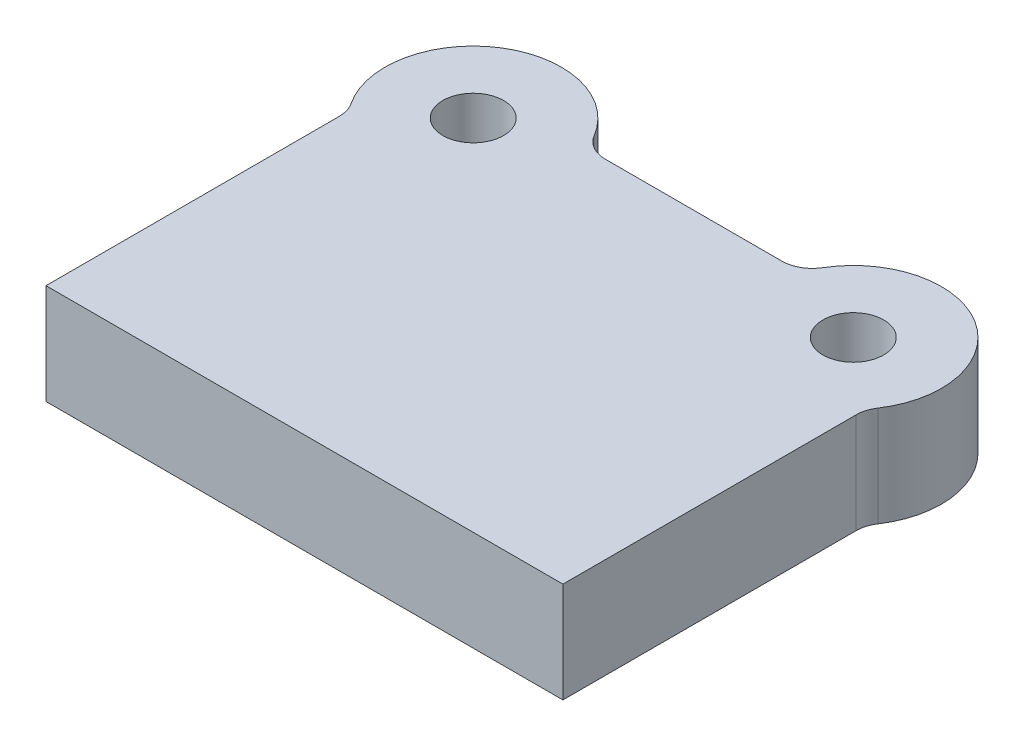
ISO-10303-21;
HEADER;
FILE_DESCRIPTION(('STEP AP214'),'2;1');
FILE_NAME('part.step','',(''),(''),'','','');
FILE_SCHEMA(('AUTOMOTIVE_DESIGN { 1 0 10303 214 1 1 1 1 }'));
ENDSEC;
DATA;
#1=APPLICATION_CONTEXT('core data for automotive mechanical design processes');
#2=APPLICATION_PROTOCOL_DEFINITION('international standard','automotive_design',2000,#1);
#3=PRODUCT_CONTEXT('',#1,'mechanical');
#4=PRODUCT('Part','Part','',(#3));
#5=PRODUCT_RELATED_PRODUCT_CATEGORY('part','',(#4));
#6=PRODUCT_DEFINITION_FORMATION('','',#4);
#7=PRODUCT_DEFINITION_CONTEXT('part definition',#1,'design');
#8=PRODUCT_DEFINITION('design','',#6,#7);
#9=PRODUCT_DEFINITION_SHAPE('','',#8);
#10=(LENGTH_UNIT() NAMED_UNIT(*) SI_UNIT(.MILLI.,.METRE.));
#11=(NAMED_UNIT(*) PLANE_ANGLE_UNIT() SI_UNIT($,.RADIAN.));
#12=(NAMED_UNIT(*) SI_UNIT($,.STERADIAN.) SOLID_ANGLE_UNIT());
#13=UNCERTAINTY_MEASURE_WITH_UNIT(LENGTH_MEASURE(1.E-05),#10,'distance_accuracy_value','');
#14=(GEOMETRIC_REPRESENTATION_CONTEXT(3) GLOBAL_UNCERTAINTY_ASSIGNED_CONTEXT((#13)) GLOBAL_UNIT_ASSIGNED_CONTEXT((#10,
#11,#12)) REPRESENTATION_CONTEXT('',''));
#15=CARTESIAN_POINT('',(0.,0.,0.));
#16=DIRECTION('',(0.,0.,1.));
#17=DIRECTION('',(1.,0.,0.));
#18=AXIS2_PLACEMENT_3D('',#15,#16,#17);
#19=CARTESIAN_POINT('',(-62.5,33.,-118.));
#20=DIRECTION('',(0.,1.,0.));
#21=DIRECTION('',(0.,0.,1.));
#22=AXIS2_PLACEMENT_3D('',#19,#20,#21);
#23=PLANE('',#22);
#24=CARTESIAN_POINT('',(-62.5,33.,-118.));
#25=DIRECTION('',(0.,1.,0.));
#26=DIRECTION('',(0.,0.,1.));
#27=AXIS2_PLACEMENT_3D('',#24,#25,#26);
#28=CIRCLE('',#27,10.);
#29=CARTESIAN_POINT('',(-62.5,33.,-108.));
#30=VERTEX_POINT('',#29);
#31=EDGE_CURVE('E209',#30,#30,#28,.T.);
#32=ORIENTED_EDGE('',*,*,#31,.F.);
#33=EDGE_LOOP('',(#32));
#34=FACE_BOUND('',#33,.T.);
#35=CARTESIAN_POINT('',(-62.5,33.,-118.));
#36=DIRECTION('',(0.,1.,0.));
#37=DIRECTION('',(0.,0.,1.));
#38=AXIS2_PLACEMENT_3D('',#35,#36,#37);
#39=CIRCLE('',#38,29.);
#40=CARTESIAN_POINT('',(-37.6036203979122,33.,-132.871794871795));
#41=VERTEX_POINT('',#40);
#42=CARTESIAN_POINT('',(-86.6666666666667,33.,-101.969646846616));
#43=VERTEX_POINT('',#42);
#44=EDGE_CURVE('E139',#41,#43,#39,.T.);
#45=ORIENTED_EDGE('',*,*,#44,.T.);
#46=CARTESIAN_POINT('',(-95.,33.,-96.4419388626899));
#47=DIRECTION('',(0.,1.,0.));
#48=DIRECTION('',(0.,0.,1.));
#49=AXIS2_PLACEMENT_3D('',#46,#47,#48);
#50=CIRCLE('',#49,10.);
#51=CARTESIAN_POINT('',(-85.,33.,-96.4419388626899));
#52=VERTEX_POINT('',#51);
#53=EDGE_CURVE('E116',#43,#52,#50,.F.);
#54=ORIENTED_EDGE('',*,*,#53,.T.);
#55=DIRECTION('',(0.,0.,1.));
#56=VECTOR('',#55,1.);
#57=CARTESIAN_POINT('',(-85.,33.,0.));
#58=LINE('',#57,#56);
#59=CARTESIAN_POINT('',(-85.,33.,0.));
#60=VERTEX_POINT('',#59);
#61=EDGE_CURVE('E109',#52,#60,#58,.T.);
#62=ORIENTED_EDGE('',*,*,#61,.T.);
#63=DIRECTION('',(1.,0.,0.));
#64=VECTOR('',#63,1.);
#65=CARTESIAN_POINT('',(85.,33.,0.));
#66=LINE('',#65,#64);
#67=CARTESIAN_POINT('',(85.,33.,0.));
#68=VERTEX_POINT('',#67);
#69=EDGE_CURVE('E113',#60,#68,#66,.T.);
#70=ORIENTED_EDGE('',*,*,#69,.T.);
#71=DIRECTION('',(0.,0.,-1.));
#72=VECTOR('',#71,1.);
#73=CARTESIAN_POINT('',(85.,33.,0.));
#74=LINE('',#73,#72);
#75=CARTESIAN_POINT('',(85.,33.,-96.4419388626899));
#76=VERTEX_POINT('',#75);
#77=EDGE_CURVE('E129',#68,#76,#74,.T.);
#78=ORIENTED_EDGE('',*,*,#77,.T.);
#79=CARTESIAN_POINT('',(95.,33.,-96.4419388626899));
#80=DIRECTION('',(0.,1.,0.));
#81=DIRECTION('',(0.,0.,1.));
#82=AXIS2_PLACEMENT_3D('',#79,#80,#81);
#83=CIRCLE('',#82,10.);
#84=CARTESIAN_POINT('',(86.6666666666667,33.,-101.969646846616));
#85=VERTEX_POINT('',#84);
#86=EDGE_CURVE('E11',#76,#85,#83,.F.);
#87=ORIENTED_EDGE('',*,*,#86,.T.);
#88=CARTESIAN_POINT('',(62.5,33.,-118.));
#89=DIRECTION('',(0.,1.,0.));
#90=DIRECTION('',(0.,0.,-1.));
#91=AXIS2_PLACEMENT_3D('',#88,#89,#90);
#92=CIRCLE('',#91,29.);
#93=CARTESIAN_POINT('',(37.6036203979122,33.,-132.871794871795));
#94=VERTEX_POINT('',#93);
#95=EDGE_CURVE('E175',#85,#94,#92,.T.);
#96=ORIENTED_EDGE('',*,*,#95,.T.);
#97=CARTESIAN_POINT('',(29.0186619144336,33.,-138.));
#98=DIRECTION('',(0.,1.,0.));
#99=DIRECTION('',(0.,0.,1.));
#100=AXIS2_PLACEMENT_3D('',#97,#98,#99);
#101=CIRCLE('',#100,10.);
#102=CARTESIAN_POINT('',(29.0186619144336,33.,-128.));
#103=VERTEX_POINT('',#102);
#104=EDGE_CURVE('E167',#94,#103,#101,.F.);
#105=ORIENTED_EDGE('',*,*,#104,.T.);
#106=DIRECTION('',(-1.,0.,0.));
#107=VECTOR('',#106,1.);
#108=CARTESIAN_POINT('',(35.2786848223676,33.,-128.));
#109=LINE('',#108,#107);
#110=CARTESIAN_POINT('',(-29.0186619144336,33.,-128.));
#111=VERTEX_POINT('',#110);
#112=EDGE_CURVE('E172',#103,#111,#109,.T.);
#113=ORIENTED_EDGE('',*,*,#112,.T.);
#114=CARTESIAN_POINT('',(-29.0186619144336,33.,-138.));
#115=DIRECTION('',(0.,1.,0.));
#116=DIRECTION('',(0.,0.,1.));
#117=AXIS2_PLACEMENT_3D('',#114,#115,#116);
#118=CIRCLE('',#117,10.);
#119=EDGE_CURVE('E163',#111,#41,#118,.F.);
#120=ORIENTED_EDGE('',*,*,#119,.T.);
#121=EDGE_LOOP('',(#45,#54,#62,#70,#78,#87,#96,#105,#113,#120));
#122=FACE_BOUND('',#121,.T.);
#123=CARTESIAN_POINT('',(62.5,33.,-118.));
#124=DIRECTION('',(0.,1.,0.));
#125=DIRECTION('',(0.,0.,-1.));
#126=AXIS2_PLACEMENT_3D('',#123,#124,#125);
#127=CIRCLE('',#126,9.99999999999999);
#128=CARTESIAN_POINT('',(62.5,33.,-128.));
#129=VERTEX_POINT('',#128);
#130=EDGE_CURVE('E219',#129,#129,#127,.T.);
#131=ORIENTED_EDGE('',*,*,#130,.F.);
#132=EDGE_LOOP('',(#131));
#133=FACE_BOUND('',#132,.T.);
#134=ADVANCED_FACE('F33',(#34,#122,#133),#23,.T.);
#135=CARTESIAN_POINT('',(-62.5,0.,-118.));
#136=DIRECTION('',(0.,1.,0.));
#137=DIRECTION('',(0.,0.,1.));
#138=AXIS2_PLACEMENT_3D('',#135,#136,#137);
#139=PLANE('',#138);
#140=DIRECTION('',(0.,0.,1.));
#141=VECTOR('',#140,1.);
#142=CARTESIAN_POINT('',(-85.,0.,0.));
#143=LINE('',#142,#141);
#144=CARTESIAN_POINT('',(-85.,0.,-96.4419388626899));
#145=VERTEX_POINT('',#144);
#146=CARTESIAN_POINT('',(-85.,0.,0.));
#147=VERTEX_POINT('',#146);
#148=EDGE_CURVE('E133',#145,#147,#143,.T.);
#149=ORIENTED_EDGE('',*,*,#148,.F.);
#150=CARTESIAN_POINT('',(-95.,0.,-96.4419388626899));
#151=DIRECTION('',(0.,1.,0.));
#152=DIRECTION('',(0.,0.,1.));
#153=AXIS2_PLACEMENT_3D('',#150,#151,#152);
#154=CIRCLE('',#153,10.);
#155=CARTESIAN_POINT('',(-86.6666666666667,0.,-101.969646846616));
#156=VERTEX_POINT('',#155);
#157=EDGE_CURVE('E158',#145,#156,#154,.T.);
#158=ORIENTED_EDGE('',*,*,#157,.T.);
#159=CARTESIAN_POINT('',(-62.5,0.,-118.));
#160=DIRECTION('',(0.,1.,0.));
#161=DIRECTION('',(0.,0.,1.));
#162=AXIS2_PLACEMENT_3D('',#159,#160,#161);
#163=CIRCLE('',#162,29.);
#164=CARTESIAN_POINT('',(-37.6036203979122,0.,-132.871794871795));
#165=VERTEX_POINT('',#164);
#166=EDGE_CURVE('E121',#165,#156,#163,.T.);
#167=ORIENTED_EDGE('',*,*,#166,.F.);
#168=CARTESIAN_POINT('',(-29.0186619144336,0.,-138.));
#169=DIRECTION('',(0.,1.,0.));
#170=DIRECTION('',(0.,0.,1.));
#171=AXIS2_PLACEMENT_3D('',#168,#169,#170);
#172=CIRCLE('',#171,10.);
#173=CARTESIAN_POINT('',(-29.0186619144336,0.,-128.));
#174=VERTEX_POINT('',#173);
#175=EDGE_CURVE('E161',#165,#174,#172,.T.);
#176=ORIENTED_EDGE('',*,*,#175,.T.);
#177=DIRECTION('',(-1.,0.,0.));
#178=VECTOR('',#177,1.);
#179=CARTESIAN_POINT('',(35.2786848223676,0.,-128.));
#180=LINE('',#179,#178);
#181=CARTESIAN_POINT('',(29.0186619144336,0.,-128.));
#182=VERTEX_POINT('',#181);
#183=EDGE_CURVE('E190',#182,#174,#180,.T.);
#184=ORIENTED_EDGE('',*,*,#183,.F.);
#185=CARTESIAN_POINT('',(29.0186619144336,0.,-138.));
#186=DIRECTION('',(0.,1.,0.));
#187=DIRECTION('',(0.,0.,1.));
#188=AXIS2_PLACEMENT_3D('',#185,#186,#187);
#189=CIRCLE('',#188,10.);
#190=CARTESIAN_POINT('',(37.6036203979122,0.,-132.871794871795));
#191=VERTEX_POINT('',#190);
#192=EDGE_CURVE('E165',#182,#191,#189,.T.);
#193=ORIENTED_EDGE('',*,*,#192,.T.);
#194=CARTESIAN_POINT('',(62.5,0.,-118.));
#195=DIRECTION('',(0.,1.,0.));
#196=DIRECTION('',(0.,0.,-1.));
#197=AXIS2_PLACEMENT_3D('',#194,#195,#196);
#198=CIRCLE('',#197,29.);
#199=CARTESIAN_POINT('',(86.6666666666667,0.,-101.969646846616));
#200=VERTEX_POINT('',#199);
#201=EDGE_CURVE('E189',#200,#191,#198,.T.);
#202=ORIENTED_EDGE('',*,*,#201,.F.);
#203=CARTESIAN_POINT('',(95.,0.,-96.4419388626899));
#204=DIRECTION('',(0.,1.,0.));
#205=DIRECTION('',(0.,0.,1.));
#206=AXIS2_PLACEMENT_3D('',#203,#204,#205);
#207=CIRCLE('',#206,10.);
#208=CARTESIAN_POINT('',(85.,0.,-96.4419388626899));
#209=VERTEX_POINT('',#208);
#210=EDGE_CURVE('E41',#200,#209,#207,.T.);
#211=ORIENTED_EDGE('',*,*,#210,.T.);
#212=DIRECTION('',(0.,0.,-1.));
#213=VECTOR('',#212,1.);
#214=CARTESIAN_POINT('',(85.,0.,0.));
#215=LINE('',#214,#213);
#216=CARTESIAN_POINT('',(85.,0.,0.));
#217=VERTEX_POINT('',#216);
#218=EDGE_CURVE('E194',#217,#209,#215,.T.);
#219=ORIENTED_EDGE('',*,*,#218,.F.);
#220=DIRECTION('',(1.,0.,0.));
#221=VECTOR('',#220,1.);
#222=CARTESIAN_POINT('',(85.,0.,0.));
#223=LINE('',#222,#221);
#224=EDGE_CURVE('E197',#147,#217,#223,.T.);
#225=ORIENTED_EDGE('',*,*,#224,.F.);
#226=EDGE_LOOP('',(#149,#158,#167,#176,#184,#193,#202,#211,#219,#225));
#227=FACE_BOUND('',#226,.T.);
#228=CARTESIAN_POINT('',(-62.5,0.,-118.));
#229=DIRECTION('',(0.,1.,0.));
#230=DIRECTION('',(0.,0.,1.));
#231=AXIS2_PLACEMENT_3D('',#228,#229,#230);
#232=CIRCLE('',#231,10.);
#233=CARTESIAN_POINT('',(-62.5,0.,-108.));
#234=VERTEX_POINT('',#233);
#235=EDGE_CURVE('E212',#234,#234,#232,.T.);
#236=ORIENTED_EDGE('',*,*,#235,.T.);
#237=EDGE_LOOP('',(#236));
#238=FACE_BOUND('',#237,.T.);
#239=CARTESIAN_POINT('',(62.5,0.,-118.));
#240=DIRECTION('',(0.,1.,0.));
#241=DIRECTION('',(0.,0.,-1.));
#242=AXIS2_PLACEMENT_3D('',#239,#240,#241);
#243=CIRCLE('',#242,9.99999999999999);
#244=CARTESIAN_POINT('',(62.5,0.,-128.));
#245=VERTEX_POINT('',#244);
#246=EDGE_CURVE('E221',#245,#245,#243,.T.);
#247=ORIENTED_EDGE('',*,*,#246,.T.);
#248=EDGE_LOOP('',(#247));
#249=FACE_BOUND('',#248,.T.);
#250=ADVANCED_FACE('F187',(#227,#238,#249),#139,.F.);
#251=CARTESIAN_POINT('',(-85.,33.,0.));
#252=DIRECTION('',(1.,0.,0.));
#253=DIRECTION('',(0.,0.,-1.));
#254=AXIS2_PLACEMENT_3D('',#251,#252,#253);
#255=PLANE('',#254);
#256=ORIENTED_EDGE('',*,*,#61,.F.);
#257=DIRECTION('',(0.,1.,0.));
#258=VECTOR('',#257,1.);
#259=CARTESIAN_POINT('',(-85.,0.,-96.4419388626899));
#260=LINE('',#259,#258);
#261=EDGE_CURVE('E135',#52,#145,#260,.F.);
#262=ORIENTED_EDGE('',*,*,#261,.T.);
#263=ORIENTED_EDGE('',*,*,#148,.T.);
#264=DIRECTION('',(0.,-1.,0.));
#265=VECTOR('',#264,1.);
#266=CARTESIAN_POINT('',(-85.,33.,0.));
#267=LINE('',#266,#265);
#268=EDGE_CURVE('E126',#60,#147,#267,.T.);
#269=ORIENTED_EDGE('',*,*,#268,.F.);
#270=EDGE_LOOP('',(#256,#262,#263,#269));
#271=FACE_BOUND('',#270,.T.);
#272=ADVANCED_FACE('F131',(#271),#255,.F.);
#273=CARTESIAN_POINT('',(85.,33.,0.));
#274=DIRECTION('',(0.,0.,-1.));
#275=DIRECTION('',(-1.,0.,0.));
#276=AXIS2_PLACEMENT_3D('',#273,#274,#275);
#277=PLANE('',#276);
#278=ORIENTED_EDGE('',*,*,#224,.T.);
#279=DIRECTION('',(0.,-1.,0.));
#280=VECTOR('',#279,1.);
#281=CARTESIAN_POINT('',(85.,33.,0.));
#282=LINE('',#281,#280);
#283=EDGE_CURVE('E128',#68,#217,#282,.T.);
#284=ORIENTED_EDGE('',*,*,#283,.F.);
#285=ORIENTED_EDGE('',*,*,#69,.F.);
#286=ORIENTED_EDGE('',*,*,#268,.T.);
#287=EDGE_LOOP('',(#278,#284,#285,#286));
#288=FACE_BOUND('',#287,.T.);
#289=ADVANCED_FACE('F125',(#288),#277,.F.);
#290=CARTESIAN_POINT('',(85.,33.,0.));
#291=DIRECTION('',(-1.,0.,0.));
#292=DIRECTION('',(0.,0.,1.));
#293=AXIS2_PLACEMENT_3D('',#290,#291,#292);
#294=PLANE('',#293);
#295=ORIENTED_EDGE('',*,*,#218,.T.);
#296=DIRECTION('',(0.,1.,0.));
#297=VECTOR('',#296,1.);
#298=CARTESIAN_POINT('',(85.,33.,-96.4419388626899));
#299=LINE('',#298,#297);
#300=EDGE_CURVE('E48',#209,#76,#299,.T.);
#301=ORIENTED_EDGE('',*,*,#300,.T.);
#302=ORIENTED_EDGE('',*,*,#77,.F.);
#303=ORIENTED_EDGE('',*,*,#283,.T.);
#304=EDGE_LOOP('',(#295,#301,#302,#303));
#305=FACE_BOUND('',#304,.T.);
#306=ADVANCED_FACE('F247',(#305),#294,.F.);
#307=CARTESIAN_POINT('',(62.5,33.,-118.));
#308=DIRECTION('',(0.,-1.,0.));
#309=DIRECTION('',(0.,0.,-1.));
#310=AXIS2_PLACEMENT_3D('',#307,#308,#309);
#311=CYLINDRICAL_SURFACE('',#310,29.);
#312=ORIENTED_EDGE('',*,*,#201,.T.);
#313=DIRECTION('',(0.,-1.,0.));
#314=VECTOR('',#313,1.);
#315=CARTESIAN_POINT('',(37.6036203979122,33.,-132.871794871795));
#316=LINE('',#315,#314);
#317=EDGE_CURVE('E155',#191,#94,#316,.F.);
#318=ORIENTED_EDGE('',*,*,#317,.T.);
#319=ORIENTED_EDGE('',*,*,#95,.F.);
#320=DIRECTION('',(0.,-1.,0.));
#321=VECTOR('',#320,1.);
#322=CARTESIAN_POINT('',(86.6666666666667,33.,-101.969646846616));
#323=LINE('',#322,#321);
#324=EDGE_CURVE('E152',#85,#200,#323,.T.);
#325=ORIENTED_EDGE('',*,*,#324,.T.);
#326=EDGE_LOOP('',(#312,#318,#319,#325));
#327=FACE_BOUND('',#326,.T.);
#328=ADVANCED_FACE('F192',(#327),#311,.T.);
#329=CARTESIAN_POINT('',(35.2786848223676,33.,-128.));
#330=DIRECTION('',(0.,0.,1.));
#331=DIRECTION('',(1.,0.,0.));
#332=AXIS2_PLACEMENT_3D('',#329,#330,#331);
#333=PLANE('',#332);
#334=ORIENTED_EDGE('',*,*,#183,.T.);
#335=DIRECTION('',(0.,1.,0.));
#336=VECTOR('',#335,1.);
#337=CARTESIAN_POINT('',(-29.0186619144336,33.,-128.));
#338=LINE('',#337,#336);
#339=EDGE_CURVE('E150',#174,#111,#338,.T.);
#340=ORIENTED_EDGE('',*,*,#339,.T.);
#341=ORIENTED_EDGE('',*,*,#112,.F.);
#342=DIRECTION('',(0.,1.,0.));
#343=VECTOR('',#342,1.);
#344=CARTESIAN_POINT('',(29.0186619144336,0.,-128.));
#345=LINE('',#344,#343);
#346=EDGE_CURVE('E147',#103,#182,#345,.F.);
#347=ORIENTED_EDGE('',*,*,#346,.T.);
#348=EDGE_LOOP('',(#334,#340,#341,#347));
#349=FACE_BOUND('',#348,.T.);
#350=ADVANCED_FACE('F181',(#349),#333,.F.);
#351=CARTESIAN_POINT('',(-62.5,33.,-118.));
#352=DIRECTION('',(0.,-1.,0.));
#353=DIRECTION('',(0.,0.,-1.));
#354=AXIS2_PLACEMENT_3D('',#351,#352,#353);
#355=CYLINDRICAL_SURFACE('',#354,29.);
#356=ORIENTED_EDGE('',*,*,#166,.T.);
#357=DIRECTION('',(0.,-1.,0.));
#358=VECTOR('',#357,1.);
#359=CARTESIAN_POINT('',(-86.6666666666667,33.,-101.969646846616));
#360=LINE('',#359,#358);
#361=EDGE_CURVE('E145',#156,#43,#360,.F.);
#362=ORIENTED_EDGE('',*,*,#361,.T.);
#363=ORIENTED_EDGE('',*,*,#44,.F.);
#364=DIRECTION('',(0.,-1.,0.));
#365=VECTOR('',#364,1.);
#366=CARTESIAN_POINT('',(-37.6036203979122,33.,-132.871794871795));
#367=LINE('',#366,#365);
#368=EDGE_CURVE('E137',#41,#165,#367,.T.);
#369=ORIENTED_EDGE('',*,*,#368,.T.);
#370=EDGE_LOOP('',(#356,#362,#363,#369));
#371=FACE_BOUND('',#370,.T.);
#372=ADVANCED_FACE('F204',(#371),#355,.T.);
#373=CARTESIAN_POINT('',(-62.5,33.,-118.));
#374=DIRECTION('',(0.,-1.,0.));
#375=DIRECTION('',(0.,0.,-1.));
#376=AXIS2_PLACEMENT_3D('',#373,#374,#375);
#377=CYLINDRICAL_SURFACE('',#376,10.);
#378=ORIENTED_EDGE('',*,*,#31,.T.);
#379=EDGE_LOOP('',(#378));
#380=FACE_BOUND('',#379,.T.);
#381=ORIENTED_EDGE('',*,*,#235,.F.);
#382=EDGE_LOOP('',(#381));
#383=FACE_BOUND('',#382,.T.);
#384=ADVANCED_FACE('F238',(#380,#383),#377,.F.);
#385=CARTESIAN_POINT('',(62.5,33.,-118.));
#386=DIRECTION('',(0.,-1.,0.));
#387=DIRECTION('',(0.,0.,-1.));
#388=AXIS2_PLACEMENT_3D('',#385,#386,#387);
#389=CYLINDRICAL_SURFACE('',#388,9.99999999999999);
#390=ORIENTED_EDGE('',*,*,#130,.T.);
#391=EDGE_LOOP('',(#390));
#392=FACE_BOUND('',#391,.T.);
#393=ORIENTED_EDGE('',*,*,#246,.F.);
#394=EDGE_LOOP('',(#393));
#395=FACE_BOUND('',#394,.T.);
#396=ADVANCED_FACE('F227',(#392,#395),#389,.F.);
#397=CARTESIAN_POINT('',(-95.,33.,-96.4419388626899));
#398=DIRECTION('',(0.,-1.,0.));
#399=DIRECTION('',(0.,0.,-1.));
#400=AXIS2_PLACEMENT_3D('',#397,#398,#399);
#401=CYLINDRICAL_SURFACE('',#400,10.);
#402=ORIENTED_EDGE('',*,*,#53,.F.);
#403=ORIENTED_EDGE('',*,*,#361,.F.);
#404=ORIENTED_EDGE('',*,*,#157,.F.);
#405=ORIENTED_EDGE('',*,*,#261,.F.);
#406=EDGE_LOOP('',(#402,#403,#404,#405));
#407=FACE_BOUND('',#406,.T.);
#408=ADVANCED_FACE('F208',(#407),#401,.F.);
#409=CARTESIAN_POINT('',(-29.0186619144336,33.,-138.));
#410=DIRECTION('',(0.,-1.,0.));
#411=DIRECTION('',(0.,0.,-1.));
#412=AXIS2_PLACEMENT_3D('',#409,#410,#411);
#413=CYLINDRICAL_SURFACE('',#412,10.);
#414=ORIENTED_EDGE('',*,*,#119,.F.);
#415=ORIENTED_EDGE('',*,*,#339,.F.);
#416=ORIENTED_EDGE('',*,*,#175,.F.);
#417=ORIENTED_EDGE('',*,*,#368,.F.);
#418=EDGE_LOOP('',(#414,#415,#416,#417));
#419=FACE_BOUND('',#418,.T.);
#420=ADVANCED_FACE('F256',(#419),#413,.F.);
#421=CARTESIAN_POINT('',(29.0186619144336,33.,-138.));
#422=DIRECTION('',(0.,-1.,0.));
#423=DIRECTION('',(0.,0.,-1.));
#424=AXIS2_PLACEMENT_3D('',#421,#422,#423);
#425=CYLINDRICAL_SURFACE('',#424,10.);
#426=ORIENTED_EDGE('',*,*,#104,.F.);
#427=ORIENTED_EDGE('',*,*,#317,.F.);
#428=ORIENTED_EDGE('',*,*,#192,.F.);
#429=ORIENTED_EDGE('',*,*,#346,.F.);
#430=EDGE_LOOP('',(#426,#427,#428,#429));
#431=FACE_BOUND('',#430,.T.);
#432=ADVANCED_FACE('F185',(#431),#425,.F.);
#433=CARTESIAN_POINT('',(95.,33.,-96.4419388626899));
#434=DIRECTION('',(0.,-1.,0.));
#435=DIRECTION('',(0.,0.,-1.));
#436=AXIS2_PLACEMENT_3D('',#433,#434,#435);
#437=CYLINDRICAL_SURFACE('',#436,10.);
#438=ORIENTED_EDGE('',*,*,#86,.F.);
#439=ORIENTED_EDGE('',*,*,#300,.F.);
#440=ORIENTED_EDGE('',*,*,#210,.F.);
#441=ORIENTED_EDGE('',*,*,#324,.F.);
#442=EDGE_LOOP('',(#438,#439,#440,#441));
#443=FACE_BOUND('',#442,.T.);
#444=ADVANCED_FACE('F35',(#443),#437,.F.);
#445=CLOSED_SHELL('',(#134,#250,#272,#289,#306,#328,#350,#372,#384,#396,#408,#420,#432,#444));
#446=MANIFOLD_SOLID_BREP('B2',#445);
#447=ADVANCED_BREP_SHAPE_REPRESENTATION('',(#18,#446),#14);
#448=SHAPE_DEFINITION_REPRESENTATION(#9,#447);
ENDSEC;
END-ISO-10303-21;
